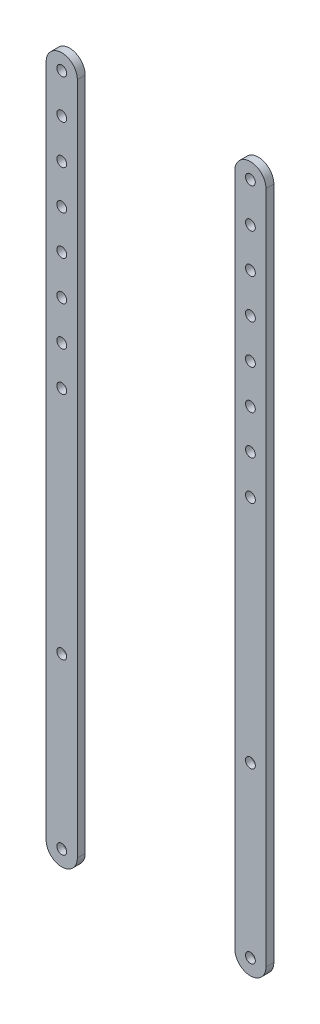
ISO-10303-21;
HEADER;
FILE_DESCRIPTION(('STEP AP214'),'2;1');
FILE_NAME('part.step','',(''),(''),'','','');
FILE_SCHEMA(('AUTOMOTIVE_DESIGN { 1 0 10303 214 1 1 1 1 }'));
ENDSEC;
DATA;
#1=APPLICATION_CONTEXT('core data for automotive mechanical design processes');
#2=APPLICATION_PROTOCOL_DEFINITION('international standard','automotive_design',2000,#1);
#3=PRODUCT_CONTEXT('',#1,'mechanical');
#4=PRODUCT('Part','Part','',(#3));
#5=PRODUCT_RELATED_PRODUCT_CATEGORY('part','',(#4));
#6=PRODUCT_DEFINITION_FORMATION('','',#4);
#7=PRODUCT_DEFINITION_CONTEXT('part definition',#1,'design');
#8=PRODUCT_DEFINITION('design','',#6,#7);
#9=PRODUCT_DEFINITION_SHAPE('','',#8);
#10=(LENGTH_UNIT() NAMED_UNIT(*) SI_UNIT(.MILLI.,.METRE.));
#11=(NAMED_UNIT(*) PLANE_ANGLE_UNIT() SI_UNIT($,.RADIAN.));
#12=(NAMED_UNIT(*) SI_UNIT($,.STERADIAN.) SOLID_ANGLE_UNIT());
#13=UNCERTAINTY_MEASURE_WITH_UNIT(LENGTH_MEASURE(1.E-05),#10,'distance_accuracy_value','');
#14=(GEOMETRIC_REPRESENTATION_CONTEXT(3) GLOBAL_UNCERTAINTY_ASSIGNED_CONTEXT((#13)) GLOBAL_UNIT_ASSIGNED_CONTEXT((#10,
#11,#12)) REPRESENTATION_CONTEXT('',''));
#15=CARTESIAN_POINT('',(0.,0.,0.));
#16=DIRECTION('',(0.,0.,1.));
#17=DIRECTION('',(1.,0.,0.));
#18=AXIS2_PLACEMENT_3D('',#15,#16,#17);
#19=CARTESIAN_POINT('',(-40.940944881886,-21.48310896621,2.));
#20=DIRECTION('',(0.,0.,-1.));
#21=DIRECTION('',(-1.,0.,0.));
#22=AXIS2_PLACEMENT_3D('',#19,#20,#21);
#23=PLANE('',#22);
#24=CARTESIAN_POINT('',(-40.940944881886,-21.48310896621,2.));
#25=DIRECTION('',(0.,0.,1.));
#26=DIRECTION('',(-1.,0.,0.));
#27=AXIS2_PLACEMENT_3D('',#24,#25,#26);
#28=CIRCLE('',#27,3.9661331312673);
#29=CARTESIAN_POINT('',(-44.9070780131533,-21.48310896621,2.));
#30=VERTEX_POINT('',#29);
#31=CARTESIAN_POINT('',(-36.9748117506187,-21.48310896621,2.));
#32=VERTEX_POINT('',#31);
#33=EDGE_CURVE('E111',#30,#32,#28,.T.);
#34=ORIENTED_EDGE('',*,*,#33,.T.);
#35=DIRECTION('',(0.,1.,0.));
#36=VECTOR('',#35,1.);
#37=CARTESIAN_POINT('',(-36.9748117506187,-21.48310896621,2.));
#38=LINE('',#37,#36);
#39=CARTESIAN_POINT('',(-36.9748117506187,150.011650805991,2.));
#40=VERTEX_POINT('',#39);
#41=EDGE_CURVE('E80',#32,#40,#38,.T.);
#42=ORIENTED_EDGE('',*,*,#41,.T.);
#43=CARTESIAN_POINT('',(-40.940944881886,150.011650805991,2.));
#44=DIRECTION('',(0.,0.,1.));
#45=DIRECTION('',(-1.,0.,0.));
#46=AXIS2_PLACEMENT_3D('',#43,#44,#45);
#47=CIRCLE('',#46,3.9661331312673);
#48=CARTESIAN_POINT('',(-44.9070780131533,150.011650805991,2.));
#49=VERTEX_POINT('',#48);
#50=EDGE_CURVE('E120',#40,#49,#47,.T.);
#51=ORIENTED_EDGE('',*,*,#50,.T.);
#52=DIRECTION('',(0.,-1.,0.));
#53=VECTOR('',#52,1.);
#54=CARTESIAN_POINT('',(-44.9070780131533,-21.48310896621,2.));
#55=LINE('',#54,#53);
#56=EDGE_CURVE('E104',#49,#30,#55,.T.);
#57=ORIENTED_EDGE('',*,*,#56,.T.);
#58=EDGE_LOOP('',(#34,#42,#51,#57));
#59=FACE_BOUND('',#58,.T.);
#60=CARTESIAN_POINT('',(-40.941071882144,-21.48310896621,2.));
#61=DIRECTION('',(0.,0.,1.));
#62=DIRECTION('',(1.,0.,0.));
#63=AXIS2_PLACEMENT_3D('',#60,#61,#62);
#64=CIRCLE('',#63,1.2500127000255);
#65=CARTESIAN_POINT('',(-39.6910591821185,-21.48310896621,2.));
#66=VERTEX_POINT('',#65);
#67=EDGE_CURVE('E118',#66,#66,#64,.T.);
#68=ORIENTED_EDGE('',*,*,#67,.F.);
#69=EDGE_LOOP('',(#68));
#70=FACE_BOUND('',#69,.T.);
#71=CARTESIAN_POINT('',(-40.940944881886,150.011650805991,2.));
#72=DIRECTION('',(0.,0.,1.));
#73=DIRECTION('',(1.,0.,0.));
#74=AXIS2_PLACEMENT_3D('',#71,#72,#73);
#75=CIRCLE('',#74,1.25001270002549);
#76=CARTESIAN_POINT('',(-39.6909321818605,150.011650805991,2.));
#77=VERTEX_POINT('',#76);
#78=EDGE_CURVE('E125',#77,#77,#75,.T.);
#79=ORIENTED_EDGE('',*,*,#78,.F.);
#80=EDGE_LOOP('',(#79));
#81=FACE_BOUND('',#80,.T.);
#82=CARTESIAN_POINT('',(-40.941071882144,21.516891033782,2.));
#83=DIRECTION('',(0.,0.,1.));
#84=DIRECTION('',(1.,0.,0.));
#85=AXIS2_PLACEMENT_3D('',#82,#83,#84);
#86=CIRCLE('',#85,1.2500127000255);
#87=CARTESIAN_POINT('',(-39.6910591821185,21.516891033782,2.));
#88=VERTEX_POINT('',#87);
#89=EDGE_CURVE('E129',#88,#88,#86,.T.);
#90=ORIENTED_EDGE('',*,*,#89,.F.);
#91=EDGE_LOOP('',(#90));
#92=FACE_BOUND('',#91,.T.);
#93=CARTESIAN_POINT('',(-40.940944881886,140.011650720212,2.));
#94=DIRECTION('',(0.,0.,1.));
#95=DIRECTION('',(1.,0.,0.));
#96=AXIS2_PLACEMENT_3D('',#93,#94,#95);
#97=CIRCLE('',#96,1.25001270002549);
#98=CARTESIAN_POINT('',(-39.6909321818605,140.011650720212,2.));
#99=VERTEX_POINT('',#98);
#100=EDGE_CURVE('E134',#99,#99,#97,.T.);
#101=ORIENTED_EDGE('',*,*,#100,.F.);
#102=EDGE_LOOP('',(#101));
#103=FACE_BOUND('',#102,.T.);
#104=CARTESIAN_POINT('',(-40.940944881886,130.011650634433,2.));
#105=DIRECTION('',(0.,0.,1.));
#106=DIRECTION('',(1.,0.,0.));
#107=AXIS2_PLACEMENT_3D('',#104,#105,#106);
#108=CIRCLE('',#107,1.25001270002548);
#109=CARTESIAN_POINT('',(-39.6909321818605,130.011650634433,2.));
#110=VERTEX_POINT('',#109);
#111=EDGE_CURVE('E138',#110,#110,#108,.T.);
#112=ORIENTED_EDGE('',*,*,#111,.F.);
#113=EDGE_LOOP('',(#112));
#114=FACE_BOUND('',#113,.T.);
#115=CARTESIAN_POINT('',(-40.940944881886,120.011650548654,2.));
#116=DIRECTION('',(0.,0.,1.));
#117=DIRECTION('',(1.,0.,0.));
#118=AXIS2_PLACEMENT_3D('',#115,#116,#117);
#119=CIRCLE('',#118,1.25001270002548);
#120=CARTESIAN_POINT('',(-39.6909321818605,120.011650548654,2.));
#121=VERTEX_POINT('',#120);
#122=EDGE_CURVE('E144',#121,#121,#119,.T.);
#123=ORIENTED_EDGE('',*,*,#122,.F.);
#124=EDGE_LOOP('',(#123));
#125=FACE_BOUND('',#124,.T.);
#126=CARTESIAN_POINT('',(-40.9409448818859,110.011650548654,2.));
#127=DIRECTION('',(0.,0.,1.));
#128=DIRECTION('',(1.,0.,0.));
#129=AXIS2_PLACEMENT_3D('',#126,#127,#128);
#130=CIRCLE('',#129,1.25001270002548);
#131=CARTESIAN_POINT('',(-39.6909321818604,110.011650548654,2.));
#132=VERTEX_POINT('',#131);
#133=EDGE_CURVE('E150',#132,#132,#130,.T.);
#134=ORIENTED_EDGE('',*,*,#133,.F.);
#135=EDGE_LOOP('',(#134));
#136=FACE_BOUND('',#135,.T.);
#137=CARTESIAN_POINT('',(-40.9409448818858,100.011650548654,2.));
#138=DIRECTION('',(0.,0.,1.));
#139=DIRECTION('',(1.,0.,0.));
#140=AXIS2_PLACEMENT_3D('',#137,#138,#139);
#141=CIRCLE('',#140,1.25001270002548);
#142=CARTESIAN_POINT('',(-39.6909321818603,100.011650548654,2.));
#143=VERTEX_POINT('',#142);
#144=EDGE_CURVE('E156',#143,#143,#141,.T.);
#145=ORIENTED_EDGE('',*,*,#144,.F.);
#146=EDGE_LOOP('',(#145));
#147=FACE_BOUND('',#146,.T.);
#148=CARTESIAN_POINT('',(-40.9409448818857,90.0116505486535,2.));
#149=DIRECTION('',(0.,0.,1.));
#150=DIRECTION('',(1.,0.,0.));
#151=AXIS2_PLACEMENT_3D('',#148,#149,#150);
#152=CIRCLE('',#151,1.25001270002548);
#153=CARTESIAN_POINT('',(-39.6909321818602,90.0116505486535,2.));
#154=VERTEX_POINT('',#153);
#155=EDGE_CURVE('E162',#154,#154,#152,.T.);
#156=ORIENTED_EDGE('',*,*,#155,.F.);
#157=EDGE_LOOP('',(#156));
#158=FACE_BOUND('',#157,.T.);
#159=CARTESIAN_POINT('',(-40.9409448818856,80.0116505486535,2.));
#160=DIRECTION('',(0.,0.,1.));
#161=DIRECTION('',(1.,0.,0.));
#162=AXIS2_PLACEMENT_3D('',#159,#160,#161);
#163=CIRCLE('',#162,1.25001270002548);
#164=CARTESIAN_POINT('',(-39.6909321818601,80.0116505486535,2.));
#165=VERTEX_POINT('',#164);
#166=EDGE_CURVE('E168',#165,#165,#163,.T.);
#167=ORIENTED_EDGE('',*,*,#166,.F.);
#168=EDGE_LOOP('',(#167));
#169=FACE_BOUND('',#168,.T.);
#170=ADVANCED_FACE('F47',(#59,#70,#81,#92,#103,#114,#125,#136,#147,#158,#169),#23,.F.);
#171=CARTESIAN_POINT('',(-40.940944881886,-21.48310896621,0.));
#172=DIRECTION('',(0.,0.,-1.));
#173=DIRECTION('',(-1.,0.,0.));
#174=AXIS2_PLACEMENT_3D('',#171,#172,#173);
#175=PLANE('',#174);
#176=CARTESIAN_POINT('',(-40.941071882144,-21.48310896621,0.));
#177=DIRECTION('',(0.,0.,-1.));
#178=DIRECTION('',(-1.,0.,0.));
#179=AXIS2_PLACEMENT_3D('',#176,#177,#178);
#180=CIRCLE('',#179,1.7500127000255);
#181=CARTESIAN_POINT('',(-42.6910845821695,-21.48310896621,0.));
#182=VERTEX_POINT('',#181);
#183=EDGE_CURVE('E179',#182,#182,#180,.F.);
#184=ORIENTED_EDGE('',*,*,#183,.T.);
#185=EDGE_LOOP('',(#184));
#186=FACE_BOUND('',#185,.T.);
#187=CARTESIAN_POINT('',(-40.941071882144,21.516891033782,0.));
#188=DIRECTION('',(0.,0.,-1.));
#189=DIRECTION('',(-1.,0.,0.));
#190=AXIS2_PLACEMENT_3D('',#187,#188,#189);
#191=CIRCLE('',#190,1.7500127000255);
#192=CARTESIAN_POINT('',(-42.6910845821695,21.516891033782,0.));
#193=VERTEX_POINT('',#192);
#194=EDGE_CURVE('E174',#193,#193,#191,.F.);
#195=ORIENTED_EDGE('',*,*,#194,.T.);
#196=EDGE_LOOP('',(#195));
#197=FACE_BOUND('',#196,.T.);
#198=CARTESIAN_POINT('',(-40.9409448818857,90.0116505486535,0.));
#199=DIRECTION('',(0.,0.,1.));
#200=DIRECTION('',(1.,0.,0.));
#201=AXIS2_PLACEMENT_3D('',#198,#199,#200);
#202=CIRCLE('',#201,1.25001270002548);
#203=CARTESIAN_POINT('',(-39.6909321818602,90.0116505486535,0.));
#204=VERTEX_POINT('',#203);
#205=EDGE_CURVE('E165',#204,#204,#202,.T.);
#206=ORIENTED_EDGE('',*,*,#205,.T.);
#207=EDGE_LOOP('',(#206));
#208=FACE_BOUND('',#207,.T.);
#209=CARTESIAN_POINT('',(-40.9409448818859,110.011650548654,0.));
#210=DIRECTION('',(0.,0.,1.));
#211=DIRECTION('',(1.,0.,0.));
#212=AXIS2_PLACEMENT_3D('',#209,#210,#211);
#213=CIRCLE('',#212,1.25001270002548);
#214=CARTESIAN_POINT('',(-39.6909321818604,110.011650548654,0.));
#215=VERTEX_POINT('',#214);
#216=EDGE_CURVE('E153',#215,#215,#213,.T.);
#217=ORIENTED_EDGE('',*,*,#216,.T.);
#218=EDGE_LOOP('',(#217));
#219=FACE_BOUND('',#218,.T.);
#220=CARTESIAN_POINT('',(-40.940944881886,130.011650634433,0.));
#221=DIRECTION('',(0.,0.,1.));
#222=DIRECTION('',(1.,0.,0.));
#223=AXIS2_PLACEMENT_3D('',#220,#221,#222);
#224=CIRCLE('',#223,1.25001270002548);
#225=CARTESIAN_POINT('',(-39.6909321818605,130.011650634433,0.));
#226=VERTEX_POINT('',#225);
#227=EDGE_CURVE('E141',#226,#226,#224,.T.);
#228=ORIENTED_EDGE('',*,*,#227,.T.);
#229=EDGE_LOOP('',(#228));
#230=FACE_BOUND('',#229,.T.);
#231=CARTESIAN_POINT('',(-40.940944881886,-21.48310896621,0.));
#232=DIRECTION('',(0.,0.,1.));
#233=DIRECTION('',(-1.,0.,0.));
#234=AXIS2_PLACEMENT_3D('',#231,#232,#233);
#235=CIRCLE('',#234,3.9661331312673);
#236=CARTESIAN_POINT('',(-44.9070780131533,-21.48310896621,0.));
#237=VERTEX_POINT('',#236);
#238=CARTESIAN_POINT('',(-36.9748117506187,-21.48310896621,0.));
#239=VERTEX_POINT('',#238);
#240=EDGE_CURVE('E110',#237,#239,#235,.T.);
#241=ORIENTED_EDGE('',*,*,#240,.F.);
#242=DIRECTION('',(0.,-1.,0.));
#243=VECTOR('',#242,1.);
#244=CARTESIAN_POINT('',(-44.9070780131533,-21.48310896621,0.));
#245=LINE('',#244,#243);
#246=CARTESIAN_POINT('',(-44.9070780131533,150.011650805991,0.));
#247=VERTEX_POINT('',#246);
#248=EDGE_CURVE('E90',#247,#237,#245,.T.);
#249=ORIENTED_EDGE('',*,*,#248,.F.);
#250=CARTESIAN_POINT('',(-40.940944881886,150.011650805991,0.));
#251=DIRECTION('',(0.,0.,1.));
#252=DIRECTION('',(-1.,0.,0.));
#253=AXIS2_PLACEMENT_3D('',#250,#251,#252);
#254=CIRCLE('',#253,3.9661331312673);
#255=CARTESIAN_POINT('',(-36.9748117506187,150.011650805991,0.));
#256=VERTEX_POINT('',#255);
#257=EDGE_CURVE('E96',#256,#247,#254,.T.);
#258=ORIENTED_EDGE('',*,*,#257,.F.);
#259=DIRECTION('',(0.,1.,0.));
#260=VECTOR('',#259,1.);
#261=CARTESIAN_POINT('',(-36.9748117506187,-21.48310896621,0.));
#262=LINE('',#261,#260);
#263=EDGE_CURVE('E64',#239,#256,#262,.T.);
#264=ORIENTED_EDGE('',*,*,#263,.F.);
#265=EDGE_LOOP('',(#241,#249,#258,#264));
#266=FACE_BOUND('',#265,.T.);
#267=CARTESIAN_POINT('',(-40.940944881886,150.011650805991,0.));
#268=DIRECTION('',(0.,0.,1.));
#269=DIRECTION('',(1.,0.,0.));
#270=AXIS2_PLACEMENT_3D('',#267,#268,#269);
#271=CIRCLE('',#270,1.25001270002549);
#272=CARTESIAN_POINT('',(-39.6909321818605,150.011650805991,0.));
#273=VERTEX_POINT('',#272);
#274=EDGE_CURVE('E126',#273,#273,#271,.T.);
#275=ORIENTED_EDGE('',*,*,#274,.T.);
#276=EDGE_LOOP('',(#275));
#277=FACE_BOUND('',#276,.T.);
#278=CARTESIAN_POINT('',(-40.940944881886,140.011650720212,0.));
#279=DIRECTION('',(0.,0.,1.));
#280=DIRECTION('',(1.,0.,0.));
#281=AXIS2_PLACEMENT_3D('',#278,#279,#280);
#282=CIRCLE('',#281,1.25001270002549);
#283=CARTESIAN_POINT('',(-39.6909321818605,140.011650720212,0.));
#284=VERTEX_POINT('',#283);
#285=EDGE_CURVE('E135',#284,#284,#282,.T.);
#286=ORIENTED_EDGE('',*,*,#285,.T.);
#287=EDGE_LOOP('',(#286));
#288=FACE_BOUND('',#287,.T.);
#289=CARTESIAN_POINT('',(-40.940944881886,120.011650548654,0.));
#290=DIRECTION('',(0.,0.,1.));
#291=DIRECTION('',(1.,0.,0.));
#292=AXIS2_PLACEMENT_3D('',#289,#290,#291);
#293=CIRCLE('',#292,1.25001270002548);
#294=CARTESIAN_POINT('',(-39.6909321818605,120.011650548654,0.));
#295=VERTEX_POINT('',#294);
#296=EDGE_CURVE('E147',#295,#295,#293,.T.);
#297=ORIENTED_EDGE('',*,*,#296,.T.);
#298=EDGE_LOOP('',(#297));
#299=FACE_BOUND('',#298,.T.);
#300=CARTESIAN_POINT('',(-40.9409448818858,100.011650548654,0.));
#301=DIRECTION('',(0.,0.,1.));
#302=DIRECTION('',(1.,0.,0.));
#303=AXIS2_PLACEMENT_3D('',#300,#301,#302);
#304=CIRCLE('',#303,1.25001270002548);
#305=CARTESIAN_POINT('',(-39.6909321818603,100.011650548654,0.));
#306=VERTEX_POINT('',#305);
#307=EDGE_CURVE('E159',#306,#306,#304,.T.);
#308=ORIENTED_EDGE('',*,*,#307,.T.);
#309=EDGE_LOOP('',(#308));
#310=FACE_BOUND('',#309,.T.);
#311=CARTESIAN_POINT('',(-40.9409448818856,80.0116505486535,0.));
#312=DIRECTION('',(0.,0.,1.));
#313=DIRECTION('',(1.,0.,0.));
#314=AXIS2_PLACEMENT_3D('',#311,#312,#313);
#315=CIRCLE('',#314,1.25001270002548);
#316=CARTESIAN_POINT('',(-39.6909321818601,80.0116505486535,0.));
#317=VERTEX_POINT('',#316);
#318=EDGE_CURVE('E171',#317,#317,#315,.T.);
#319=ORIENTED_EDGE('',*,*,#318,.T.);
#320=EDGE_LOOP('',(#319));
#321=FACE_BOUND('',#320,.T.);
#322=ADVANCED_FACE('F107',(#186,#197,#208,#219,#230,#266,#277,#288,#299,#310,#321),#175,.T.);
#323=CARTESIAN_POINT('',(-40.940944881886,-21.48310896621,2.));
#324=DIRECTION('',(0.,0.,-1.));
#325=DIRECTION('',(-1.,0.,0.));
#326=AXIS2_PLACEMENT_3D('',#323,#324,#325);
#327=CYLINDRICAL_SURFACE('',#326,3.9661331312673);
#328=ORIENTED_EDGE('',*,*,#240,.T.);
#329=DIRECTION('',(0.,0.,-1.));
#330=VECTOR('',#329,1.);
#331=CARTESIAN_POINT('',(-36.9748117506187,-21.48310896621,2.));
#332=LINE('',#331,#330);
#333=EDGE_CURVE('E434',#32,#239,#332,.T.);
#334=ORIENTED_EDGE('',*,*,#333,.F.);
#335=ORIENTED_EDGE('',*,*,#33,.F.);
#336=DIRECTION('',(0.,0.,-1.));
#337=VECTOR('',#336,1.);
#338=CARTESIAN_POINT('',(-44.9070780131533,-21.48310896621,2.));
#339=LINE('',#338,#337);
#340=EDGE_CURVE('E105',#30,#237,#339,.T.);
#341=ORIENTED_EDGE('',*,*,#340,.T.);
#342=EDGE_LOOP('',(#328,#334,#335,#341));
#343=FACE_BOUND('',#342,.T.);
#344=ADVANCED_FACE('F195',(#343),#327,.T.);
#345=CARTESIAN_POINT('',(-36.9748117506187,-21.48310896621,2.));
#346=DIRECTION('',(-1.,0.,0.));
#347=DIRECTION('',(0.,0.,1.));
#348=AXIS2_PLACEMENT_3D('',#345,#346,#347);
#349=PLANE('',#348);
#350=ORIENTED_EDGE('',*,*,#263,.T.);
#351=DIRECTION('',(0.,0.,-1.));
#352=VECTOR('',#351,1.);
#353=CARTESIAN_POINT('',(-36.9748117506187,150.011650805991,2.));
#354=LINE('',#353,#352);
#355=EDGE_CURVE('E101',#40,#256,#354,.T.);
#356=ORIENTED_EDGE('',*,*,#355,.F.);
#357=ORIENTED_EDGE('',*,*,#41,.F.);
#358=ORIENTED_EDGE('',*,*,#333,.T.);
#359=EDGE_LOOP('',(#350,#356,#357,#358));
#360=FACE_BOUND('',#359,.T.);
#361=ADVANCED_FACE('F390',(#360),#349,.F.);
#362=CARTESIAN_POINT('',(-40.940944881886,150.011650805991,2.));
#363=DIRECTION('',(0.,0.,-1.));
#364=DIRECTION('',(-1.,0.,0.));
#365=AXIS2_PLACEMENT_3D('',#362,#363,#364);
#366=CYLINDRICAL_SURFACE('',#365,3.9661331312673);
#367=ORIENTED_EDGE('',*,*,#257,.T.);
#368=DIRECTION('',(0.,0.,-1.));
#369=VECTOR('',#368,1.);
#370=CARTESIAN_POINT('',(-44.9070780131533,150.011650805991,2.));
#371=LINE('',#370,#369);
#372=EDGE_CURVE('E99',#49,#247,#371,.T.);
#373=ORIENTED_EDGE('',*,*,#372,.F.);
#374=ORIENTED_EDGE('',*,*,#50,.F.);
#375=ORIENTED_EDGE('',*,*,#355,.T.);
#376=EDGE_LOOP('',(#367,#373,#374,#375));
#377=FACE_BOUND('',#376,.T.);
#378=ADVANCED_FACE('F97',(#377),#366,.T.);
#379=CARTESIAN_POINT('',(-44.9070780131533,-21.48310896621,2.));
#380=DIRECTION('',(1.,0.,0.));
#381=DIRECTION('',(0.,0.,-1.));
#382=AXIS2_PLACEMENT_3D('',#379,#380,#381);
#383=PLANE('',#382);
#384=ORIENTED_EDGE('',*,*,#248,.T.);
#385=ORIENTED_EDGE('',*,*,#340,.F.);
#386=ORIENTED_EDGE('',*,*,#56,.F.);
#387=ORIENTED_EDGE('',*,*,#372,.T.);
#388=EDGE_LOOP('',(#384,#385,#386,#387));
#389=FACE_BOUND('',#388,.T.);
#390=ADVANCED_FACE('F103',(#389),#383,.F.);
#391=CARTESIAN_POINT('',(-40.941071882144,-21.48310896621,2.));
#392=DIRECTION('',(0.,0.,-1.));
#393=DIRECTION('',(-1.,0.,0.));
#394=AXIS2_PLACEMENT_3D('',#391,#392,#393);
#395=CYLINDRICAL_SURFACE('',#394,1.2500127000255);
#396=CARTESIAN_POINT('',(-40.941071882144,-21.48310896621,0.5));
#397=DIRECTION('',(0.,0.,-1.));
#398=DIRECTION('',(-1.,0.,0.));
#399=AXIS2_PLACEMENT_3D('',#396,#397,#398);
#400=CIRCLE('',#399,1.2500127000255);
#401=CARTESIAN_POINT('',(-42.1910845821695,-21.48310896621,0.5));
#402=VERTEX_POINT('',#401);
#403=EDGE_CURVE('E56',#402,#402,#400,.T.);
#404=ORIENTED_EDGE('',*,*,#403,.T.);
#405=EDGE_LOOP('',(#404));
#406=FACE_BOUND('',#405,.T.);
#407=ORIENTED_EDGE('',*,*,#67,.T.);
#408=EDGE_LOOP('',(#407));
#409=FACE_BOUND('',#408,.T.);
#410=ADVANCED_FACE('F184',(#406,#409),#395,.F.);
#411=CARTESIAN_POINT('',(-40.940944881886,150.011650805991,2.));
#412=DIRECTION('',(0.,0.,-1.));
#413=DIRECTION('',(-1.,0.,0.));
#414=AXIS2_PLACEMENT_3D('',#411,#412,#413);
#415=CYLINDRICAL_SURFACE('',#414,1.25001270002549);
#416=ORIENTED_EDGE('',*,*,#274,.F.);
#417=EDGE_LOOP('',(#416));
#418=FACE_BOUND('',#417,.T.);
#419=ORIENTED_EDGE('',*,*,#78,.T.);
#420=EDGE_LOOP('',(#419));
#421=FACE_BOUND('',#420,.T.);
#422=ADVANCED_FACE('F230',(#418,#421),#415,.F.);
#423=CARTESIAN_POINT('',(-40.941071882144,21.516891033782,2.));
#424=DIRECTION('',(0.,0.,-1.));
#425=DIRECTION('',(-1.,0.,0.));
#426=AXIS2_PLACEMENT_3D('',#423,#424,#425);
#427=CYLINDRICAL_SURFACE('',#426,1.2500127000255);
#428=CARTESIAN_POINT('',(-40.941071882144,21.516891033782,0.5));
#429=DIRECTION('',(0.,0.,-1.));
#430=DIRECTION('',(-1.,0.,0.));
#431=AXIS2_PLACEMENT_3D('',#428,#429,#430);
#432=CIRCLE('',#431,1.2500127000255);
#433=CARTESIAN_POINT('',(-42.1910845821695,21.516891033782,0.5));
#434=VERTEX_POINT('',#433);
#435=EDGE_CURVE('E12',#434,#434,#432,.T.);
#436=ORIENTED_EDGE('',*,*,#435,.T.);
#437=EDGE_LOOP('',(#436));
#438=FACE_BOUND('',#437,.T.);
#439=ORIENTED_EDGE('',*,*,#89,.T.);
#440=EDGE_LOOP('',(#439));
#441=FACE_BOUND('',#440,.T.);
#442=ADVANCED_FACE('F218',(#438,#441),#427,.F.);
#443=CARTESIAN_POINT('',(-40.940944881886,140.011650720212,2.));
#444=DIRECTION('',(0.,0.,-1.));
#445=DIRECTION('',(-1.,0.,0.));
#446=AXIS2_PLACEMENT_3D('',#443,#444,#445);
#447=CYLINDRICAL_SURFACE('',#446,1.25001270002549);
#448=ORIENTED_EDGE('',*,*,#100,.T.);
#449=EDGE_LOOP('',(#448));
#450=FACE_BOUND('',#449,.T.);
#451=ORIENTED_EDGE('',*,*,#285,.F.);
#452=EDGE_LOOP('',(#451));
#453=FACE_BOUND('',#452,.T.);
#454=ADVANCED_FACE('F208',(#450,#453),#447,.F.);
#455=CARTESIAN_POINT('',(-40.940944881886,130.011650634433,2.));
#456=DIRECTION('',(0.,0.,-1.));
#457=DIRECTION('',(-1.,0.,0.));
#458=AXIS2_PLACEMENT_3D('',#455,#456,#457);
#459=CYLINDRICAL_SURFACE('',#458,1.25001270002548);
#460=ORIENTED_EDGE('',*,*,#111,.T.);
#461=EDGE_LOOP('',(#460));
#462=FACE_BOUND('',#461,.T.);
#463=ORIENTED_EDGE('',*,*,#227,.F.);
#464=EDGE_LOOP('',(#463));
#465=FACE_BOUND('',#464,.T.);
#466=ADVANCED_FACE('F205',(#462,#465),#459,.F.);
#467=CARTESIAN_POINT('',(-40.940944881886,120.011650548654,2.));
#468=DIRECTION('',(0.,0.,-1.));
#469=DIRECTION('',(-1.,0.,0.));
#470=AXIS2_PLACEMENT_3D('',#467,#468,#469);
#471=CYLINDRICAL_SURFACE('',#470,1.25001270002548);
#472=ORIENTED_EDGE('',*,*,#122,.T.);
#473=EDGE_LOOP('',(#472));
#474=FACE_BOUND('',#473,.T.);
#475=ORIENTED_EDGE('',*,*,#296,.F.);
#476=EDGE_LOOP('',(#475));
#477=FACE_BOUND('',#476,.T.);
#478=ADVANCED_FACE('F207',(#474,#477),#471,.F.);
#479=CARTESIAN_POINT('',(-40.9409448818859,110.011650548654,2.));
#480=DIRECTION('',(0.,0.,-1.));
#481=DIRECTION('',(-1.,0.,0.));
#482=AXIS2_PLACEMENT_3D('',#479,#480,#481);
#483=CYLINDRICAL_SURFACE('',#482,1.25001270002548);
#484=ORIENTED_EDGE('',*,*,#133,.T.);
#485=EDGE_LOOP('',(#484));
#486=FACE_BOUND('',#485,.T.);
#487=ORIENTED_EDGE('',*,*,#216,.F.);
#488=EDGE_LOOP('',(#487));
#489=FACE_BOUND('',#488,.T.);
#490=ADVANCED_FACE('F215',(#486,#489),#483,.F.);
#491=CARTESIAN_POINT('',(-40.9409448818858,100.011650548654,2.));
#492=DIRECTION('',(0.,0.,-1.));
#493=DIRECTION('',(-1.,0.,0.));
#494=AXIS2_PLACEMENT_3D('',#491,#492,#493);
#495=CYLINDRICAL_SURFACE('',#494,1.25001270002548);
#496=ORIENTED_EDGE('',*,*,#144,.T.);
#497=EDGE_LOOP('',(#496));
#498=FACE_BOUND('',#497,.T.);
#499=ORIENTED_EDGE('',*,*,#307,.F.);
#500=EDGE_LOOP('',(#499));
#501=FACE_BOUND('',#500,.T.);
#502=ADVANCED_FACE('F266',(#498,#501),#495,.F.);
#503=CARTESIAN_POINT('',(-40.9409448818857,90.0116505486535,2.));
#504=DIRECTION('',(0.,0.,-1.));
#505=DIRECTION('',(-1.,0.,0.));
#506=AXIS2_PLACEMENT_3D('',#503,#504,#505);
#507=CYLINDRICAL_SURFACE('',#506,1.25001270002548);
#508=ORIENTED_EDGE('',*,*,#155,.T.);
#509=EDGE_LOOP('',(#508));
#510=FACE_BOUND('',#509,.T.);
#511=ORIENTED_EDGE('',*,*,#205,.F.);
#512=EDGE_LOOP('',(#511));
#513=FACE_BOUND('',#512,.T.);
#514=ADVANCED_FACE('F259',(#510,#513),#507,.F.);
#515=CARTESIAN_POINT('',(-40.9409448818856,80.0116505486535,2.));
#516=DIRECTION('',(0.,0.,-1.));
#517=DIRECTION('',(-1.,0.,0.));
#518=AXIS2_PLACEMENT_3D('',#515,#516,#517);
#519=CYLINDRICAL_SURFACE('',#518,1.25001270002548);
#520=ORIENTED_EDGE('',*,*,#166,.T.);
#521=EDGE_LOOP('',(#520));
#522=FACE_BOUND('',#521,.T.);
#523=ORIENTED_EDGE('',*,*,#318,.F.);
#524=EDGE_LOOP('',(#523));
#525=FACE_BOUND('',#524,.T.);
#526=ADVANCED_FACE('F190',(#522,#525),#519,.F.);
#527=CARTESIAN_POINT('',(-40.941071882144,-21.48310896621,0.5));
#528=DIRECTION('',(0.,0.,-1.));
#529=DIRECTION('',(-1.,0.,0.));
#530=AXIS2_PLACEMENT_3D('',#527,#528,#529);
#531=TOROIDAL_SURFACE('',#530,1.7500127000255,0.5);
#532=ORIENTED_EDGE('',*,*,#403,.F.);
#533=EDGE_LOOP('',(#532));
#534=FACE_BOUND('',#533,.T.);
#535=ORIENTED_EDGE('',*,*,#183,.F.);
#536=EDGE_LOOP('',(#535));
#537=FACE_BOUND('',#536,.T.);
#538=ADVANCED_FACE('F187',(#534,#537),#531,.T.);
#539=CARTESIAN_POINT('',(-40.941071882144,21.516891033782,0.5));
#540=DIRECTION('',(0.,0.,-1.));
#541=DIRECTION('',(-1.,0.,0.));
#542=AXIS2_PLACEMENT_3D('',#539,#540,#541);
#543=TOROIDAL_SURFACE('',#542,1.7500127000255,0.5);
#544=ORIENTED_EDGE('',*,*,#435,.F.);
#545=EDGE_LOOP('',(#544));
#546=FACE_BOUND('',#545,.T.);
#547=ORIENTED_EDGE('',*,*,#194,.F.);
#548=EDGE_LOOP('',(#547));
#549=FACE_BOUND('',#548,.T.);
#550=ADVANCED_FACE('F49',(#546,#549),#543,.T.);
#551=CLOSED_SHELL('',(#170,#322,#344,#361,#378,#390,#410,#422,#442,#454,#466,#478,#490,#502,
#514,#526,#538,#550));
#552=MANIFOLD_SOLID_BREP('B2',#551);
#553=CARTESIAN_POINT('',(-88.941071882144,-21.48310896621,2.));
#554=DIRECTION('',(0.,0.,1.));
#555=DIRECTION('',(1.,0.,0.));
#556=AXIS2_PLACEMENT_3D('',#553,#554,#555);
#557=PLANE('',#556);
#558=CARTESIAN_POINT('',(-88.9410718821437,90.0116505486535,2.));
#559=DIRECTION('',(0.,0.,1.));
#560=DIRECTION('',(1.,0.,0.));
#561=AXIS2_PLACEMENT_3D('',#558,#559,#560);
#562=CIRCLE('',#561,1.25001270002549);
#563=CARTESIAN_POINT('',(-87.6910591821182,90.0116505486535,2.));
#564=VERTEX_POINT('',#563);
#565=EDGE_CURVE('E597',#564,#564,#562,.T.);
#566=ORIENTED_EDGE('',*,*,#565,.F.);
#567=EDGE_LOOP('',(#566));
#568=FACE_BOUND('',#567,.T.);
#569=CARTESIAN_POINT('',(-88.9410718821439,110.011650548654,2.));
#570=DIRECTION('',(0.,0.,1.));
#571=DIRECTION('',(1.,0.,0.));
#572=AXIS2_PLACEMENT_3D('',#569,#570,#571);
#573=CIRCLE('',#572,1.25001270002549);
#574=CARTESIAN_POINT('',(-87.6910591821184,110.011650548654,2.));
#575=VERTEX_POINT('',#574);
#576=EDGE_CURVE('E605',#575,#575,#573,.T.);
#577=ORIENTED_EDGE('',*,*,#576,.F.);
#578=EDGE_LOOP('',(#577));
#579=FACE_BOUND('',#578,.T.);
#580=CARTESIAN_POINT('',(-88.941071882144,150.011650805991,2.));
#581=DIRECTION('',(0.,0.,1.));
#582=DIRECTION('',(1.,0.,0.));
#583=AXIS2_PLACEMENT_3D('',#580,#581,#582);
#584=CIRCLE('',#583,1.25001270002549);
#585=CARTESIAN_POINT('',(-87.6910591821185,150.011650805991,2.));
#586=VERTEX_POINT('',#585);
#587=EDGE_CURVE('E613',#586,#586,#584,.T.);
#588=ORIENTED_EDGE('',*,*,#587,.F.);
#589=EDGE_LOOP('',(#588));
#590=FACE_BOUND('',#589,.T.);
#591=CARTESIAN_POINT('',(-88.941071882144,140.011650720212,2.));
#592=DIRECTION('',(0.,0.,1.));
#593=DIRECTION('',(1.,0.,0.));
#594=AXIS2_PLACEMENT_3D('',#591,#592,#593);
#595=CIRCLE('',#594,1.25001270002549);
#596=CARTESIAN_POINT('',(-87.6910591821185,140.011650720212,2.));
#597=VERTEX_POINT('',#596);
#598=EDGE_CURVE('E621',#597,#597,#595,.T.);
#599=ORIENTED_EDGE('',*,*,#598,.F.);
#600=EDGE_LOOP('',(#599));
#601=FACE_BOUND('',#600,.T.);
#602=CARTESIAN_POINT('',(-88.941071882144,-21.48310896621,2.));
#603=DIRECTION('',(0.,0.,1.));
#604=DIRECTION('',(1.,0.,0.));
#605=AXIS2_PLACEMENT_3D('',#602,#603,#604);
#606=CIRCLE('',#605,1.25001270002549);
#607=CARTESIAN_POINT('',(-87.6910591821185,-21.48310896621,2.));
#608=VERTEX_POINT('',#607);
#609=EDGE_CURVE('E527',#608,#608,#606,.T.);
#610=ORIENTED_EDGE('',*,*,#609,.F.);
#611=EDGE_LOOP('',(#610));
#612=FACE_BOUND('',#611,.T.);
#613=CARTESIAN_POINT('',(-88.941071882144,-21.48310896621,2.));
#614=DIRECTION('',(0.,0.,1.));
#615=DIRECTION('',(1.,0.,0.));
#616=AXIS2_PLACEMENT_3D('',#613,#614,#615);
#617=CIRCLE('',#616,3.9661331312673);
#618=CARTESIAN_POINT('',(-92.9072050134113,-21.48310896621,2.));
#619=VERTEX_POINT('',#618);
#620=CARTESIAN_POINT('',(-84.9749387508767,-21.48310896621,2.));
#621=VERTEX_POINT('',#620);
#622=EDGE_CURVE('E509',#619,#621,#617,.T.);
#623=ORIENTED_EDGE('',*,*,#622,.T.);
#624=DIRECTION('',(0.,1.,0.));
#625=VECTOR('',#624,1.);
#626=CARTESIAN_POINT('',(-84.9749387508767,-21.48310896621,2.));
#627=LINE('',#626,#625);
#628=CARTESIAN_POINT('',(-84.9749387508767,150.011650805991,2.));
#629=VERTEX_POINT('',#628);
#630=EDGE_CURVE('E504',#621,#629,#627,.T.);
#631=ORIENTED_EDGE('',*,*,#630,.T.);
#632=CARTESIAN_POINT('',(-88.941071882144,150.011650805991,2.));
#633=DIRECTION('',(0.,0.,1.));
#634=DIRECTION('',(1.,0.,0.));
#635=AXIS2_PLACEMENT_3D('',#632,#633,#634);
#636=CIRCLE('',#635,3.9661331312673);
#637=CARTESIAN_POINT('',(-92.9072050134113,150.011650805991,2.));
#638=VERTEX_POINT('',#637);
#639=EDGE_CURVE('E507',#629,#638,#636,.T.);
#640=ORIENTED_EDGE('',*,*,#639,.T.);
#641=DIRECTION('',(0.,-1.,0.));
#642=VECTOR('',#641,1.);
#643=CARTESIAN_POINT('',(-92.9072050134113,-21.48310896621,2.));
#644=LINE('',#643,#642);
#645=EDGE_CURVE('E473',#638,#619,#644,.T.);
#646=ORIENTED_EDGE('',*,*,#645,.T.);
#647=EDGE_LOOP('',(#623,#631,#640,#646));
#648=FACE_BOUND('',#647,.T.);
#649=CARTESIAN_POINT('',(-88.941071882144,21.516891033782,2.));
#650=DIRECTION('',(0.,0.,1.));
#651=DIRECTION('',(1.,0.,0.));
#652=AXIS2_PLACEMENT_3D('',#649,#650,#651);
#653=CIRCLE('',#652,1.25001270002549);
#654=CARTESIAN_POINT('',(-87.6910591821185,21.516891033782,2.));
#655=VERTEX_POINT('',#654);
#656=EDGE_CURVE('E624',#655,#655,#653,.T.);
#657=ORIENTED_EDGE('',*,*,#656,.F.);
#658=EDGE_LOOP('',(#657));
#659=FACE_BOUND('',#658,.T.);
#660=CARTESIAN_POINT('',(-88.941071882144,130.011650634433,2.));
#661=DIRECTION('',(0.,0.,1.));
#662=DIRECTION('',(1.,0.,0.));
#663=AXIS2_PLACEMENT_3D('',#660,#661,#662);
#664=CIRCLE('',#663,1.25001270002549);
#665=CARTESIAN_POINT('',(-87.6910591821185,130.011650634433,2.));
#666=VERTEX_POINT('',#665);
#667=EDGE_CURVE('E617',#666,#666,#664,.T.);
#668=ORIENTED_EDGE('',*,*,#667,.F.);
#669=EDGE_LOOP('',(#668));
#670=FACE_BOUND('',#669,.T.);
#671=CARTESIAN_POINT('',(-88.941071882144,120.011650548654,2.));
#672=DIRECTION('',(0.,0.,1.));
#673=DIRECTION('',(1.,0.,0.));
#674=AXIS2_PLACEMENT_3D('',#671,#672,#673);
#675=CIRCLE('',#674,1.25001270002549);
#676=CARTESIAN_POINT('',(-87.6910591821185,120.011650548654,2.));
#677=VERTEX_POINT('',#676);
#678=EDGE_CURVE('E609',#677,#677,#675,.T.);
#679=ORIENTED_EDGE('',*,*,#678,.F.);
#680=EDGE_LOOP('',(#679));
#681=FACE_BOUND('',#680,.T.);
#682=CARTESIAN_POINT('',(-88.9410718821438,100.011650548654,2.));
#683=DIRECTION('',(0.,0.,1.));
#684=DIRECTION('',(1.,0.,0.));
#685=AXIS2_PLACEMENT_3D('',#682,#683,#684);
#686=CIRCLE('',#685,1.25001270002549);
#687=CARTESIAN_POINT('',(-87.6910591821183,100.011650548654,2.));
#688=VERTEX_POINT('',#687);
#689=EDGE_CURVE('E601',#688,#688,#686,.T.);
#690=ORIENTED_EDGE('',*,*,#689,.F.);
#691=EDGE_LOOP('',(#690));
#692=FACE_BOUND('',#691,.T.);
#693=CARTESIAN_POINT('',(-88.9410718821436,80.0116505486535,2.));
#694=DIRECTION('',(0.,0.,1.));
#695=DIRECTION('',(1.,0.,0.));
#696=AXIS2_PLACEMENT_3D('',#693,#694,#695);
#697=CIRCLE('',#696,1.25001270002548);
#698=CARTESIAN_POINT('',(-87.6910591821181,80.0116505486535,2.));
#699=VERTEX_POINT('',#698);
#700=EDGE_CURVE('E592',#699,#699,#697,.T.);
#701=ORIENTED_EDGE('',*,*,#700,.F.);
#702=EDGE_LOOP('',(#701));
#703=FACE_BOUND('',#702,.T.);
#704=ADVANCED_FACE('F456',(#568,#579,#590,#601,#612,#648,#659,#670,#681,#692,#703),#557,.T.);
#705=CARTESIAN_POINT('',(-88.941071882144,-21.48310896621,0.));
#706=DIRECTION('',(0.,0.,1.));
#707=DIRECTION('',(1.,0.,0.));
#708=AXIS2_PLACEMENT_3D('',#705,#706,#707);
#709=PLANE('',#708);
#710=CARTESIAN_POINT('',(-88.941071882144,-21.48310896621,0.));
#711=DIRECTION('',(0.,0.,1.));
#712=DIRECTION('',(1.,0.,0.));
#713=AXIS2_PLACEMENT_3D('',#710,#711,#712);
#714=CIRCLE('',#713,1.75001270002549);
#715=CARTESIAN_POINT('',(-87.1910591821185,-21.48310896621,0.));
#716=VERTEX_POINT('',#715);
#717=EDGE_CURVE('E537',#716,#716,#714,.T.);
#718=ORIENTED_EDGE('',*,*,#717,.T.);
#719=EDGE_LOOP('',(#718));
#720=FACE_BOUND('',#719,.T.);
#721=CARTESIAN_POINT('',(-88.941071882144,21.516891033782,0.));
#722=DIRECTION('',(0.,0.,1.));
#723=DIRECTION('',(1.,0.,0.));
#724=AXIS2_PLACEMENT_3D('',#721,#722,#723);
#725=CIRCLE('',#724,1.75001270002549);
#726=CARTESIAN_POINT('',(-87.1910591821185,21.516891033782,0.));
#727=VERTEX_POINT('',#726);
#728=EDGE_CURVE('E534',#727,#727,#725,.T.);
#729=ORIENTED_EDGE('',*,*,#728,.T.);
#730=EDGE_LOOP('',(#729));
#731=FACE_BOUND('',#730,.T.);
#732=CARTESIAN_POINT('',(-88.941071882144,-21.48310896621,0.));
#733=DIRECTION('',(0.,0.,1.));
#734=DIRECTION('',(1.,0.,0.));
#735=AXIS2_PLACEMENT_3D('',#732,#733,#734);
#736=CIRCLE('',#735,3.9661331312673);
#737=CARTESIAN_POINT('',(-92.9072050134113,-21.48310896621,0.));
#738=VERTEX_POINT('',#737);
#739=CARTESIAN_POINT('',(-84.9749387508767,-21.48310896621,0.));
#740=VERTEX_POINT('',#739);
#741=EDGE_CURVE('E524',#738,#740,#736,.T.);
#742=ORIENTED_EDGE('',*,*,#741,.F.);
#743=DIRECTION('',(0.,-1.,0.));
#744=VECTOR('',#743,1.);
#745=CARTESIAN_POINT('',(-92.9072050134113,-21.48310896621,0.));
#746=LINE('',#745,#744);
#747=CARTESIAN_POINT('',(-92.9072050134113,150.011650805991,0.));
#748=VERTEX_POINT('',#747);
#749=EDGE_CURVE('E496',#748,#738,#746,.T.);
#750=ORIENTED_EDGE('',*,*,#749,.F.);
#751=CARTESIAN_POINT('',(-88.941071882144,150.011650805991,0.));
#752=DIRECTION('',(0.,0.,1.));
#753=DIRECTION('',(1.,0.,0.));
#754=AXIS2_PLACEMENT_3D('',#751,#752,#753);
#755=CIRCLE('',#754,3.9661331312673);
#756=CARTESIAN_POINT('',(-84.9749387508767,150.011650805991,0.));
#757=VERTEX_POINT('',#756);
#758=EDGE_CURVE('E490',#757,#748,#755,.T.);
#759=ORIENTED_EDGE('',*,*,#758,.F.);
#760=DIRECTION('',(0.,1.,0.));
#761=VECTOR('',#760,1.);
#762=CARTESIAN_POINT('',(-84.9749387508767,-21.48310896621,0.));
#763=LINE('',#762,#761);
#764=EDGE_CURVE('E514',#740,#757,#763,.T.);
#765=ORIENTED_EDGE('',*,*,#764,.F.);
#766=EDGE_LOOP('',(#742,#750,#759,#765));
#767=FACE_BOUND('',#766,.T.);
#768=CARTESIAN_POINT('',(-88.941071882144,140.011650720212,0.));
#769=DIRECTION('',(0.,0.,1.));
#770=DIRECTION('',(1.,0.,0.));
#771=AXIS2_PLACEMENT_3D('',#768,#769,#770);
#772=CIRCLE('',#771,1.25001270002549);
#773=CARTESIAN_POINT('',(-87.6910591821185,140.011650720212,0.));
#774=VERTEX_POINT('',#773);
#775=EDGE_CURVE('E563',#774,#774,#772,.T.);
#776=ORIENTED_EDGE('',*,*,#775,.T.);
#777=EDGE_LOOP('',(#776));
#778=FACE_BOUND('',#777,.T.);
#779=CARTESIAN_POINT('',(-88.941071882144,130.011650634433,0.));
#780=DIRECTION('',(0.,0.,1.));
#781=DIRECTION('',(1.,0.,0.));
#782=AXIS2_PLACEMENT_3D('',#779,#780,#781);
#783=CIRCLE('',#782,1.25001270002549);
#784=CARTESIAN_POINT('',(-87.6910591821185,130.011650634433,0.));
#785=VERTEX_POINT('',#784);
#786=EDGE_CURVE('E567',#785,#785,#783,.T.);
#787=ORIENTED_EDGE('',*,*,#786,.T.);
#788=EDGE_LOOP('',(#787));
#789=FACE_BOUND('',#788,.T.);
#790=CARTESIAN_POINT('',(-88.941071882144,150.011650805991,0.));
#791=DIRECTION('',(0.,0.,1.));
#792=DIRECTION('',(1.,0.,0.));
#793=AXIS2_PLACEMENT_3D('',#790,#791,#792);
#794=CIRCLE('',#793,1.25001270002549);
#795=CARTESIAN_POINT('',(-87.6910591821185,150.011650805991,0.));
#796=VERTEX_POINT('',#795);
#797=EDGE_CURVE('E571',#796,#796,#794,.T.);
#798=ORIENTED_EDGE('',*,*,#797,.T.);
#799=EDGE_LOOP('',(#798));
#800=FACE_BOUND('',#799,.T.);
#801=CARTESIAN_POINT('',(-88.941071882144,120.011650548654,0.));
#802=DIRECTION('',(0.,0.,1.));
#803=DIRECTION('',(1.,0.,0.));
#804=AXIS2_PLACEMENT_3D('',#801,#802,#803);
#805=CIRCLE('',#804,1.25001270002549);
#806=CARTESIAN_POINT('',(-87.6910591821185,120.011650548654,0.));
#807=VERTEX_POINT('',#806);
#808=EDGE_CURVE('E575',#807,#807,#805,.T.);
#809=ORIENTED_EDGE('',*,*,#808,.T.);
#810=EDGE_LOOP('',(#809));
#811=FACE_BOUND('',#810,.T.);
#812=CARTESIAN_POINT('',(-88.9410718821439,110.011650548654,0.));
#813=DIRECTION('',(0.,0.,1.));
#814=DIRECTION('',(1.,0.,0.));
#815=AXIS2_PLACEMENT_3D('',#812,#813,#814);
#816=CIRCLE('',#815,1.25001270002549);
#817=CARTESIAN_POINT('',(-87.6910591821184,110.011650548654,0.));
#818=VERTEX_POINT('',#817);
#819=EDGE_CURVE('E579',#818,#818,#816,.T.);
#820=ORIENTED_EDGE('',*,*,#819,.T.);
#821=EDGE_LOOP('',(#820));
#822=FACE_BOUND('',#821,.T.);
#823=CARTESIAN_POINT('',(-88.9410718821438,100.011650548654,0.));
#824=DIRECTION('',(0.,0.,1.));
#825=DIRECTION('',(1.,0.,0.));
#826=AXIS2_PLACEMENT_3D('',#823,#824,#825);
#827=CIRCLE('',#826,1.25001270002549);
#828=CARTESIAN_POINT('',(-87.6910591821183,100.011650548654,0.));
#829=VERTEX_POINT('',#828);
#830=EDGE_CURVE('E583',#829,#829,#827,.T.);
#831=ORIENTED_EDGE('',*,*,#830,.T.);
#832=EDGE_LOOP('',(#831));
#833=FACE_BOUND('',#832,.T.);
#834=CARTESIAN_POINT('',(-88.9410718821437,90.0116505486535,0.));
#835=DIRECTION('',(0.,0.,1.));
#836=DIRECTION('',(1.,0.,0.));
#837=AXIS2_PLACEMENT_3D('',#834,#835,#836);
#838=CIRCLE('',#837,1.25001270002549);
#839=CARTESIAN_POINT('',(-87.6910591821182,90.0116505486535,0.));
#840=VERTEX_POINT('',#839);
#841=EDGE_CURVE('E587',#840,#840,#838,.T.);
#842=ORIENTED_EDGE('',*,*,#841,.T.);
#843=EDGE_LOOP('',(#842));
#844=FACE_BOUND('',#843,.T.);
#845=CARTESIAN_POINT('',(-88.9410718821436,80.0116505486535,0.));
#846=DIRECTION('',(0.,0.,1.));
#847=DIRECTION('',(1.,0.,0.));
#848=AXIS2_PLACEMENT_3D('',#845,#846,#847);
#849=CIRCLE('',#848,1.25001270002548);
#850=CARTESIAN_POINT('',(-87.6910591821181,80.0116505486535,0.));
#851=VERTEX_POINT('',#850);
#852=EDGE_CURVE('E590',#851,#851,#849,.T.);
#853=ORIENTED_EDGE('',*,*,#852,.T.);
#854=EDGE_LOOP('',(#853));
#855=FACE_BOUND('',#854,.T.);
#856=ADVANCED_FACE('F551',(#720,#731,#767,#778,#789,#800,#811,#822,#833,#844,#855),#709,.F.);
#857=CARTESIAN_POINT('',(-88.941071882144,-21.48310896621,2.));
#858=DIRECTION('',(0.,0.,-1.));
#859=DIRECTION('',(-1.,0.,0.));
#860=AXIS2_PLACEMENT_3D('',#857,#858,#859);
#861=CYLINDRICAL_SURFACE('',#860,3.9661331312673);
#862=ORIENTED_EDGE('',*,*,#741,.T.);
#863=DIRECTION('',(0.,0.,-1.));
#864=VECTOR('',#863,1.);
#865=CARTESIAN_POINT('',(-84.9749387508767,-21.48310896621,2.));
#866=LINE('',#865,#864);
#867=EDGE_CURVE('E515',#621,#740,#866,.T.);
#868=ORIENTED_EDGE('',*,*,#867,.F.);
#869=ORIENTED_EDGE('',*,*,#622,.F.);
#870=DIRECTION('',(0.,0.,-1.));
#871=VECTOR('',#870,1.);
#872=CARTESIAN_POINT('',(-92.9072050134113,-21.48310896621,2.));
#873=LINE('',#872,#871);
#874=EDGE_CURVE('E520',#619,#738,#873,.T.);
#875=ORIENTED_EDGE('',*,*,#874,.T.);
#876=EDGE_LOOP('',(#862,#868,#869,#875));
#877=FACE_BOUND('',#876,.T.);
#878=ADVANCED_FACE('F554',(#877),#861,.T.);
#879=CARTESIAN_POINT('',(-84.9749387508767,-21.48310896621,2.));
#880=DIRECTION('',(-1.,0.,0.));
#881=DIRECTION('',(0.,0.,1.));
#882=AXIS2_PLACEMENT_3D('',#879,#880,#881);
#883=PLANE('',#882);
#884=ORIENTED_EDGE('',*,*,#764,.T.);
#885=DIRECTION('',(0.,0.,-1.));
#886=VECTOR('',#885,1.);
#887=CARTESIAN_POINT('',(-84.9749387508767,150.011650805991,2.));
#888=LINE('',#887,#886);
#889=EDGE_CURVE('E512',#629,#757,#888,.T.);
#890=ORIENTED_EDGE('',*,*,#889,.F.);
#891=ORIENTED_EDGE('',*,*,#630,.F.);
#892=ORIENTED_EDGE('',*,*,#867,.T.);
#893=EDGE_LOOP('',(#884,#890,#891,#892));
#894=FACE_BOUND('',#893,.T.);
#895=ADVANCED_FACE('F513',(#894),#883,.F.);
#896=CARTESIAN_POINT('',(-88.941071882144,150.011650805991,2.));
#897=DIRECTION('',(0.,0.,-1.));
#898=DIRECTION('',(-1.,0.,0.));
#899=AXIS2_PLACEMENT_3D('',#896,#897,#898);
#900=CYLINDRICAL_SURFACE('',#899,3.9661331312673);
#901=ORIENTED_EDGE('',*,*,#758,.T.);
#902=DIRECTION('',(0.,0.,-1.));
#903=VECTOR('',#902,1.);
#904=CARTESIAN_POINT('',(-92.9072050134113,150.011650805991,2.));
#905=LINE('',#904,#903);
#906=EDGE_CURVE('E516',#638,#748,#905,.T.);
#907=ORIENTED_EDGE('',*,*,#906,.F.);
#908=ORIENTED_EDGE('',*,*,#639,.F.);
#909=ORIENTED_EDGE('',*,*,#889,.T.);
#910=EDGE_LOOP('',(#901,#907,#908,#909));
#911=FACE_BOUND('',#910,.T.);
#912=ADVANCED_FACE('F518',(#911),#900,.T.);
#913=CARTESIAN_POINT('',(-92.9072050134113,-21.48310896621,2.));
#914=DIRECTION('',(1.,0.,0.));
#915=DIRECTION('',(0.,0.,-1.));
#916=AXIS2_PLACEMENT_3D('',#913,#914,#915);
#917=PLANE('',#916);
#918=ORIENTED_EDGE('',*,*,#749,.T.);
#919=ORIENTED_EDGE('',*,*,#874,.F.);
#920=ORIENTED_EDGE('',*,*,#645,.F.);
#921=ORIENTED_EDGE('',*,*,#906,.T.);
#922=EDGE_LOOP('',(#918,#919,#920,#921));
#923=FACE_BOUND('',#922,.T.);
#924=ADVANCED_FACE('F641',(#923),#917,.F.);
#925=CARTESIAN_POINT('',(-88.941071882144,-21.48310896621,2.));
#926=DIRECTION('',(0.,0.,-1.));
#927=DIRECTION('',(-1.,0.,0.));
#928=AXIS2_PLACEMENT_3D('',#925,#926,#927);
#929=CYLINDRICAL_SURFACE('',#928,1.25001270002549);
#930=CARTESIAN_POINT('',(-88.941071882144,-21.48310896621,0.5));
#931=DIRECTION('',(0.,0.,1.));
#932=DIRECTION('',(1.,0.,0.));
#933=AXIS2_PLACEMENT_3D('',#930,#931,#932);
#934=CIRCLE('',#933,1.25001270002549);
#935=CARTESIAN_POINT('',(-87.6910591821185,-21.48310896621,0.5));
#936=VERTEX_POINT('',#935);
#937=EDGE_CURVE('E465',#936,#936,#934,.F.);
#938=ORIENTED_EDGE('',*,*,#937,.T.);
#939=EDGE_LOOP('',(#938));
#940=FACE_BOUND('',#939,.T.);
#941=ORIENTED_EDGE('',*,*,#609,.T.);
#942=EDGE_LOOP('',(#941));
#943=FACE_BOUND('',#942,.T.);
#944=ADVANCED_FACE('F542',(#940,#943),#929,.F.);
#945=CARTESIAN_POINT('',(-88.941071882144,21.516891033782,2.));
#946=DIRECTION('',(0.,0.,-1.));
#947=DIRECTION('',(-1.,0.,0.));
#948=AXIS2_PLACEMENT_3D('',#945,#946,#947);
#949=CYLINDRICAL_SURFACE('',#948,1.25001270002549);
#950=CARTESIAN_POINT('',(-88.941071882144,21.516891033782,0.5));
#951=DIRECTION('',(0.,0.,1.));
#952=DIRECTION('',(1.,0.,0.));
#953=AXIS2_PLACEMENT_3D('',#950,#951,#952);
#954=CIRCLE('',#953,1.25001270002549);
#955=CARTESIAN_POINT('',(-87.6910591821185,21.516891033782,0.5));
#956=VERTEX_POINT('',#955);
#957=EDGE_CURVE('E45',#956,#956,#954,.F.);
#958=ORIENTED_EDGE('',*,*,#957,.T.);
#959=EDGE_LOOP('',(#958));
#960=FACE_BOUND('',#959,.T.);
#961=ORIENTED_EDGE('',*,*,#656,.T.);
#962=EDGE_LOOP('',(#961));
#963=FACE_BOUND('',#962,.T.);
#964=ADVANCED_FACE('F673',(#960,#963),#949,.F.);
#965=CARTESIAN_POINT('',(-88.941071882144,140.011650720212,2.));
#966=DIRECTION('',(0.,0.,-1.));
#967=DIRECTION('',(-1.,0.,0.));
#968=AXIS2_PLACEMENT_3D('',#965,#966,#967);
#969=CYLINDRICAL_SURFACE('',#968,1.25001270002549);
#970=ORIENTED_EDGE('',*,*,#598,.T.);
#971=EDGE_LOOP('',(#970));
#972=FACE_BOUND('',#971,.T.);
#973=ORIENTED_EDGE('',*,*,#775,.F.);
#974=EDGE_LOOP('',(#973));
#975=FACE_BOUND('',#974,.T.);
#976=ADVANCED_FACE('F679',(#972,#975),#969,.F.);
#977=CARTESIAN_POINT('',(-88.941071882144,130.011650634433,2.));
#978=DIRECTION('',(0.,0.,-1.));
#979=DIRECTION('',(-1.,0.,0.));
#980=AXIS2_PLACEMENT_3D('',#977,#978,#979);
#981=CYLINDRICAL_SURFACE('',#980,1.25001270002549);
#982=ORIENTED_EDGE('',*,*,#667,.T.);
#983=EDGE_LOOP('',(#982));
#984=FACE_BOUND('',#983,.T.);
#985=ORIENTED_EDGE('',*,*,#786,.F.);
#986=EDGE_LOOP('',(#985));
#987=FACE_BOUND('',#986,.T.);
#988=ADVANCED_FACE('F686',(#984,#987),#981,.F.);
#989=CARTESIAN_POINT('',(-88.941071882144,150.011650805991,2.));
#990=DIRECTION('',(0.,0.,-1.));
#991=DIRECTION('',(-1.,0.,0.));
#992=AXIS2_PLACEMENT_3D('',#989,#990,#991);
#993=CYLINDRICAL_SURFACE('',#992,1.25001270002549);
#994=ORIENTED_EDGE('',*,*,#797,.F.);
#995=EDGE_LOOP('',(#994));
#996=FACE_BOUND('',#995,.T.);
#997=ORIENTED_EDGE('',*,*,#587,.T.);
#998=EDGE_LOOP('',(#997));
#999=FACE_BOUND('',#998,.T.);
#1000=ADVANCED_FACE('F694',(#996,#999),#993,.F.);
#1001=CARTESIAN_POINT('',(-88.941071882144,120.011650548654,2.));
#1002=DIRECTION('',(0.,0.,-1.));
#1003=DIRECTION('',(-1.,0.,0.));
#1004=AXIS2_PLACEMENT_3D('',#1001,#1002,#1003);
#1005=CYLINDRICAL_SURFACE('',#1004,1.25001270002549);
#1006=ORIENTED_EDGE('',*,*,#678,.T.);
#1007=EDGE_LOOP('',(#1006));
#1008=FACE_BOUND('',#1007,.T.);
#1009=ORIENTED_EDGE('',*,*,#808,.F.);
#1010=EDGE_LOOP('',(#1009));
#1011=FACE_BOUND('',#1010,.T.);
#1012=ADVANCED_FACE('F702',(#1008,#1011),#1005,.F.);
#1013=CARTESIAN_POINT('',(-88.9410718821439,110.011650548654,2.));
#1014=DIRECTION('',(0.,0.,-1.));
#1015=DIRECTION('',(-1.,0.,0.));
#1016=AXIS2_PLACEMENT_3D('',#1013,#1014,#1015);
#1017=CYLINDRICAL_SURFACE('',#1016,1.25001270002549);
#1018=ORIENTED_EDGE('',*,*,#576,.T.);
#1019=EDGE_LOOP('',(#1018));
#1020=FACE_BOUND('',#1019,.T.);
#1021=ORIENTED_EDGE('',*,*,#819,.F.);
#1022=EDGE_LOOP('',(#1021));
#1023=FACE_BOUND('',#1022,.T.);
#1024=ADVANCED_FACE('F710',(#1020,#1023),#1017,.F.);
#1025=CARTESIAN_POINT('',(-88.9410718821438,100.011650548654,2.));
#1026=DIRECTION('',(0.,0.,-1.));
#1027=DIRECTION('',(-1.,0.,0.));
#1028=AXIS2_PLACEMENT_3D('',#1025,#1026,#1027);
#1029=CYLINDRICAL_SURFACE('',#1028,1.25001270002549);
#1030=ORIENTED_EDGE('',*,*,#689,.T.);
#1031=EDGE_LOOP('',(#1030));
#1032=FACE_BOUND('',#1031,.T.);
#1033=ORIENTED_EDGE('',*,*,#830,.F.);
#1034=EDGE_LOOP('',(#1033));
#1035=FACE_BOUND('',#1034,.T.);
#1036=ADVANCED_FACE('F718',(#1032,#1035),#1029,.F.);
#1037=CARTESIAN_POINT('',(-88.9410718821437,90.0116505486535,2.));
#1038=DIRECTION('',(0.,0.,-1.));
#1039=DIRECTION('',(-1.,0.,0.));
#1040=AXIS2_PLACEMENT_3D('',#1037,#1038,#1039);
#1041=CYLINDRICAL_SURFACE('',#1040,1.25001270002549);
#1042=ORIENTED_EDGE('',*,*,#565,.T.);
#1043=EDGE_LOOP('',(#1042));
#1044=FACE_BOUND('',#1043,.T.);
#1045=ORIENTED_EDGE('',*,*,#841,.F.);
#1046=EDGE_LOOP('',(#1045));
#1047=FACE_BOUND('',#1046,.T.);
#1048=ADVANCED_FACE('F726',(#1044,#1047),#1041,.F.);
#1049=CARTESIAN_POINT('',(-88.9410718821436,80.0116505486535,2.));
#1050=DIRECTION('',(0.,0.,-1.));
#1051=DIRECTION('',(-1.,0.,0.));
#1052=AXIS2_PLACEMENT_3D('',#1049,#1050,#1051);
#1053=CYLINDRICAL_SURFACE('',#1052,1.25001270002548);
#1054=ORIENTED_EDGE('',*,*,#700,.T.);
#1055=EDGE_LOOP('',(#1054));
#1056=FACE_BOUND('',#1055,.T.);
#1057=ORIENTED_EDGE('',*,*,#852,.F.);
#1058=EDGE_LOOP('',(#1057));
#1059=FACE_BOUND('',#1058,.T.);
#1060=ADVANCED_FACE('F548',(#1056,#1059),#1053,.F.);
#1061=CARTESIAN_POINT('',(-88.941071882144,-21.48310896621,0.5));
#1062=DIRECTION('',(0.,0.,1.));
#1063=DIRECTION('',(1.,0.,0.));
#1064=AXIS2_PLACEMENT_3D('',#1061,#1062,#1063);
#1065=TOROIDAL_SURFACE('',#1064,1.75001270002549,0.5);
#1066=ORIENTED_EDGE('',*,*,#937,.F.);
#1067=EDGE_LOOP('',(#1066));
#1068=FACE_BOUND('',#1067,.T.);
#1069=ORIENTED_EDGE('',*,*,#717,.F.);
#1070=EDGE_LOOP('',(#1069));
#1071=FACE_BOUND('',#1070,.T.);
#1072=ADVANCED_FACE('F545',(#1068,#1071),#1065,.T.);
#1073=CARTESIAN_POINT('',(-88.941071882144,21.516891033782,0.5));
#1074=DIRECTION('',(0.,0.,1.));
#1075=DIRECTION('',(1.,0.,0.));
#1076=AXIS2_PLACEMENT_3D('',#1073,#1074,#1075);
#1077=TOROIDAL_SURFACE('',#1076,1.75001270002549,0.5);
#1078=ORIENTED_EDGE('',*,*,#957,.F.);
#1079=EDGE_LOOP('',(#1078));
#1080=FACE_BOUND('',#1079,.T.);
#1081=ORIENTED_EDGE('',*,*,#728,.F.);
#1082=EDGE_LOOP('',(#1081));
#1083=FACE_BOUND('',#1082,.T.);
#1084=ADVANCED_FACE('F458',(#1080,#1083),#1077,.T.);
#1085=CLOSED_SHELL('',(#704,#856,#878,#895,#912,#924,#944,#964,#976,#988,#1000,#1012,#1024,
#1036,#1048,#1060,#1072,#1084));
#1086=MANIFOLD_SOLID_BREP('B6',#1085);
#1087=ADVANCED_BREP_SHAPE_REPRESENTATION('',(#18,#552,#1086),#14);
#1088=SHAPE_DEFINITION_REPRESENTATION(#9,#1087);
ENDSEC;
END-ISO-10303-21;
